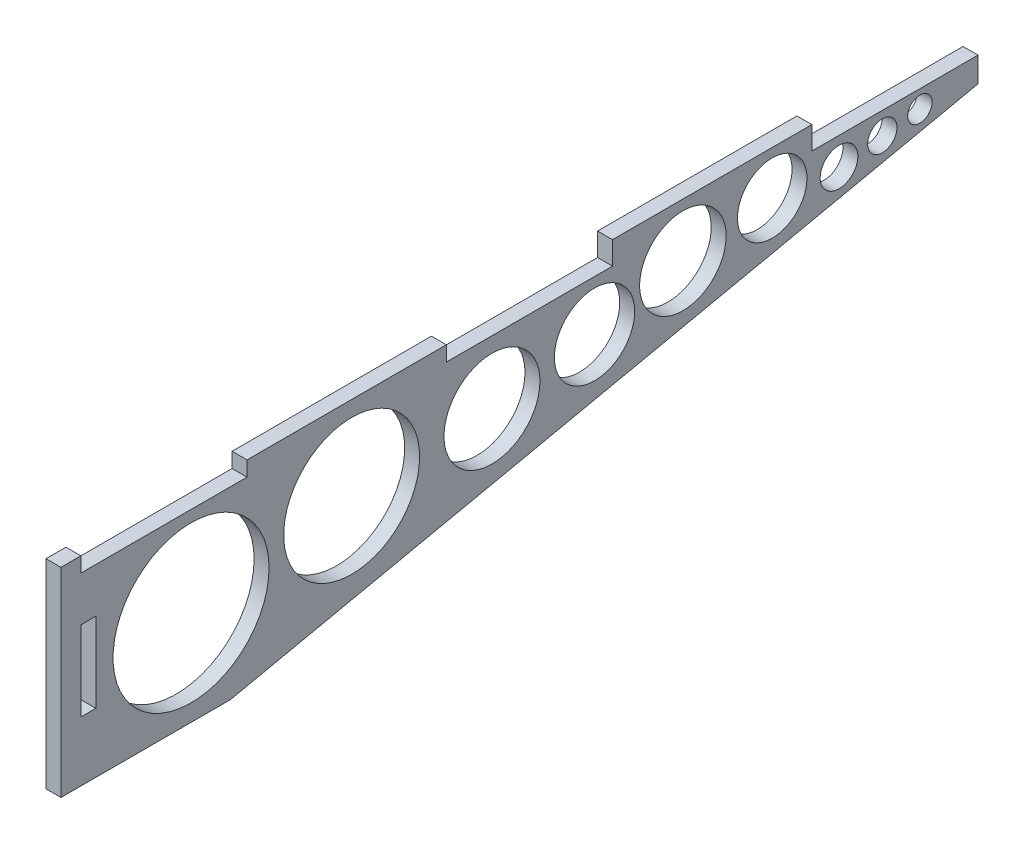
ISO-10303-21;
HEADER;
FILE_DESCRIPTION(('STEP AP214'),'2;1');
FILE_NAME('part.step','',(''),(''),'','','');
FILE_SCHEMA(('AUTOMOTIVE_DESIGN { 1 0 10303 214 1 1 1 1 }'));
ENDSEC;
DATA;
#1=APPLICATION_CONTEXT('core data for automotive mechanical design processes');
#2=APPLICATION_PROTOCOL_DEFINITION('international standard','automotive_design',2000,#1);
#3=PRODUCT_CONTEXT('',#1,'mechanical');
#4=PRODUCT('Part','Part','',(#3));
#5=PRODUCT_RELATED_PRODUCT_CATEGORY('part','',(#4));
#6=PRODUCT_DEFINITION_FORMATION('','',#4);
#7=PRODUCT_DEFINITION_CONTEXT('part definition',#1,'design');
#8=PRODUCT_DEFINITION('design','',#6,#7);
#9=PRODUCT_DEFINITION_SHAPE('','',#8);
#10=(LENGTH_UNIT() NAMED_UNIT(*) SI_UNIT(.MILLI.,.METRE.));
#11=(NAMED_UNIT(*) PLANE_ANGLE_UNIT() SI_UNIT($,.RADIAN.));
#12=(NAMED_UNIT(*) SI_UNIT($,.STERADIAN.) SOLID_ANGLE_UNIT());
#13=UNCERTAINTY_MEASURE_WITH_UNIT(LENGTH_MEASURE(1.E-05),#10,'distance_accuracy_value','');
#14=(GEOMETRIC_REPRESENTATION_CONTEXT(3) GLOBAL_UNCERTAINTY_ASSIGNED_CONTEXT((#13)) GLOBAL_UNIT_ASSIGNED_CONTEXT((#10,
#11,#12)) REPRESENTATION_CONTEXT('',''));
#15=CARTESIAN_POINT('',(0.,0.,0.));
#16=DIRECTION('',(0.,0.,1.));
#17=DIRECTION('',(1.,0.,0.));
#18=AXIS2_PLACEMENT_3D('',#15,#16,#17);
#19=CARTESIAN_POINT('',(3.,-12.,0.));
#20=DIRECTION('',(0.,1.,0.));
#21=DIRECTION('',(0.,0.,1.));
#22=AXIS2_PLACEMENT_3D('',#19,#20,#21);
#23=PLANE('',#22);
#24=DIRECTION('',(0.,0.,-1.));
#25=VECTOR('',#24,1.);
#26=CARTESIAN_POINT('',(0.,-12.,0.));
#27=LINE('',#26,#25);
#28=CARTESIAN_POINT('',(0.,-12.,0.));
#29=VERTEX_POINT('',#28);
#30=CARTESIAN_POINT('',(0.,-12.,-3.));
#31=VERTEX_POINT('',#30);
#32=EDGE_CURVE('E237',#29,#31,#27,.T.);
#33=ORIENTED_EDGE('',*,*,#32,.T.);
#34=DIRECTION('',(-1.,0.,0.));
#35=VECTOR('',#34,1.);
#36=CARTESIAN_POINT('',(3.,-12.,-3.));
#37=LINE('',#36,#35);
#38=CARTESIAN_POINT('',(3.,-12.,-3.));
#39=VERTEX_POINT('',#38);
#40=EDGE_CURVE('E11',#39,#31,#37,.T.);
#41=ORIENTED_EDGE('',*,*,#40,.F.);
#42=DIRECTION('',(0.,0.,-1.));
#43=VECTOR('',#42,1.);
#44=CARTESIAN_POINT('',(3.,-12.,0.));
#45=LINE('',#44,#43);
#46=CARTESIAN_POINT('',(3.,-12.,0.));
#47=VERTEX_POINT('',#46);
#48=EDGE_CURVE('E177',#47,#39,#45,.T.);
#49=ORIENTED_EDGE('',*,*,#48,.F.);
#50=DIRECTION('',(-1.,0.,0.));
#51=VECTOR('',#50,1.);
#52=CARTESIAN_POINT('',(3.,-12.,0.));
#53=LINE('',#52,#51);
#54=EDGE_CURVE('E58',#47,#29,#53,.T.);
#55=ORIENTED_EDGE('',*,*,#54,.T.);
#56=EDGE_LOOP('',(#33,#41,#49,#55));
#57=FACE_BOUND('',#56,.T.);
#58=ADVANCED_FACE('F39',(#57),#23,.F.);
#59=CARTESIAN_POINT('',(3.,0.,-3.));
#60=DIRECTION('',(0.,0.,-1.));
#61=DIRECTION('',(0.,1.,0.));
#62=AXIS2_PLACEMENT_3D('',#59,#60,#61);
#63=PLANE('',#62);
#64=DIRECTION('',(0.,-1.,0.));
#65=VECTOR('',#64,1.);
#66=CARTESIAN_POINT('',(0.,0.,-3.));
#67=LINE('',#66,#65);
#68=CARTESIAN_POINT('',(0.,-28.,-3.));
#69=VERTEX_POINT('',#68);
#70=EDGE_CURVE('E183',#31,#69,#67,.T.);
#71=ORIENTED_EDGE('',*,*,#70,.T.);
#72=DIRECTION('',(-1.,0.,0.));
#73=VECTOR('',#72,1.);
#74=CARTESIAN_POINT('',(3.,-28.,-3.));
#75=LINE('',#74,#73);
#76=CARTESIAN_POINT('',(3.,-28.,-3.));
#77=VERTEX_POINT('',#76);
#78=EDGE_CURVE('E49',#77,#69,#75,.T.);
#79=ORIENTED_EDGE('',*,*,#78,.F.);
#80=DIRECTION('',(0.,-1.,0.));
#81=VECTOR('',#80,1.);
#82=CARTESIAN_POINT('',(3.,0.,-3.));
#83=LINE('',#82,#81);
#84=EDGE_CURVE('E171',#39,#77,#83,.T.);
#85=ORIENTED_EDGE('',*,*,#84,.F.);
#86=ORIENTED_EDGE('',*,*,#40,.T.);
#87=EDGE_LOOP('',(#71,#79,#85,#86));
#88=FACE_BOUND('',#87,.T.);
#89=ADVANCED_FACE('F182',(#88),#63,.F.);
#90=CARTESIAN_POINT('',(3.,-28.,0.));
#91=DIRECTION('',(0.,1.,0.));
#92=DIRECTION('',(0.,0.,1.));
#93=AXIS2_PLACEMENT_3D('',#90,#91,#92);
#94=PLANE('',#93);
#95=DIRECTION('',(0.,0.,-1.));
#96=VECTOR('',#95,1.);
#97=CARTESIAN_POINT('',(0.,-28.,0.));
#98=LINE('',#97,#96);
#99=CARTESIAN_POINT('',(0.,-28.,0.));
#100=VERTEX_POINT('',#99);
#101=EDGE_CURVE('E240',#100,#69,#98,.T.);
#102=ORIENTED_EDGE('',*,*,#101,.F.);
#103=DIRECTION('',(-1.,0.,0.));
#104=VECTOR('',#103,1.);
#105=CARTESIAN_POINT('',(3.,-28.,0.));
#106=LINE('',#105,#104);
#107=CARTESIAN_POINT('',(3.,-28.,0.));
#108=VERTEX_POINT('',#107);
#109=EDGE_CURVE('E112',#108,#100,#106,.T.);
#110=ORIENTED_EDGE('',*,*,#109,.F.);
#111=DIRECTION('',(0.,0.,-1.));
#112=VECTOR('',#111,1.);
#113=CARTESIAN_POINT('',(3.,-28.,0.));
#114=LINE('',#113,#112);
#115=EDGE_CURVE('E176',#108,#77,#114,.T.);
#116=ORIENTED_EDGE('',*,*,#115,.T.);
#117=ORIENTED_EDGE('',*,*,#78,.T.);
#118=EDGE_LOOP('',(#102,#110,#116,#117));
#119=FACE_BOUND('',#118,.T.);
#120=ADVANCED_FACE('F187',(#119),#94,.T.);
#121=CARTESIAN_POINT('',(3.,0.,0.));
#122=DIRECTION('',(0.,1.,0.));
#123=DIRECTION('',(0.,0.,1.));
#124=AXIS2_PLACEMENT_3D('',#121,#122,#123);
#125=PLANE('',#124);
#126=DIRECTION('',(0.,0.,-1.));
#127=VECTOR('',#126,1.);
#128=CARTESIAN_POINT('',(0.,0.,0.));
#129=LINE('',#128,#127);
#130=CARTESIAN_POINT('',(0.,0.,4.));
#131=VERTEX_POINT('',#130);
#132=CARTESIAN_POINT('',(0.,0.,0.));
#133=VERTEX_POINT('',#132);
#134=EDGE_CURVE('E194',#131,#133,#129,.T.);
#135=ORIENTED_EDGE('',*,*,#134,.F.);
#136=DIRECTION('',(-1.,0.,0.));
#137=VECTOR('',#136,1.);
#138=CARTESIAN_POINT('',(3.,0.,4.));
#139=LINE('',#138,#137);
#140=CARTESIAN_POINT('',(3.,0.,4.));
#141=VERTEX_POINT('',#140);
#142=EDGE_CURVE('E124',#141,#131,#139,.T.);
#143=ORIENTED_EDGE('',*,*,#142,.F.);
#144=DIRECTION('',(0.,0.,-1.));
#145=VECTOR('',#144,1.);
#146=CARTESIAN_POINT('',(3.,0.,0.));
#147=LINE('',#146,#145);
#148=CARTESIAN_POINT('',(3.,0.,0.));
#149=VERTEX_POINT('',#148);
#150=EDGE_CURVE('E245',#141,#149,#147,.T.);
#151=ORIENTED_EDGE('',*,*,#150,.T.);
#152=DIRECTION('',(-1.,0.,0.));
#153=VECTOR('',#152,1.);
#154=CARTESIAN_POINT('',(3.,0.,0.));
#155=LINE('',#154,#153);
#156=EDGE_CURVE('E190',#149,#133,#155,.T.);
#157=ORIENTED_EDGE('',*,*,#156,.T.);
#158=EDGE_LOOP('',(#135,#143,#151,#157));
#159=FACE_BOUND('',#158,.T.);
#160=ADVANCED_FACE('F41',(#159),#125,.T.);
#161=CARTESIAN_POINT('',(3.,0.,4.));
#162=DIRECTION('',(0.,0.,1.));
#163=DIRECTION('',(1.,0.,0.));
#164=AXIS2_PLACEMENT_3D('',#161,#162,#163);
#165=PLANE('',#164);
#166=DIRECTION('',(0.,1.,0.));
#167=VECTOR('',#166,1.);
#168=CARTESIAN_POINT('',(0.,0.,4.));
#169=LINE('',#168,#167);
#170=CARTESIAN_POINT('',(0.,-40.,4.));
#171=VERTEX_POINT('',#170);
#172=EDGE_CURVE('E197',#171,#131,#169,.T.);
#173=ORIENTED_EDGE('',*,*,#172,.F.);
#174=DIRECTION('',(-1.,0.,0.));
#175=VECTOR('',#174,1.);
#176=CARTESIAN_POINT('',(3.,-40.,4.));
#177=LINE('',#176,#175);
#178=CARTESIAN_POINT('',(3.,-40.,4.));
#179=VERTEX_POINT('',#178);
#180=EDGE_CURVE('E269',#179,#171,#177,.T.);
#181=ORIENTED_EDGE('',*,*,#180,.F.);
#182=DIRECTION('',(0.,1.,0.));
#183=VECTOR('',#182,1.);
#184=CARTESIAN_POINT('',(3.,0.,4.));
#185=LINE('',#184,#183);
#186=EDGE_CURVE('E317',#179,#141,#185,.T.);
#187=ORIENTED_EDGE('',*,*,#186,.T.);
#188=ORIENTED_EDGE('',*,*,#142,.T.);
#189=EDGE_LOOP('',(#173,#181,#187,#188));
#190=FACE_BOUND('',#189,.T.);
#191=ADVANCED_FACE('F371',(#190),#165,.T.);
#192=CARTESIAN_POINT('',(3.,-40.,0.));
#193=DIRECTION('',(0.,-1.,0.));
#194=DIRECTION('',(0.,0.,-1.));
#195=AXIS2_PLACEMENT_3D('',#192,#193,#194);
#196=PLANE('',#195);
#197=DIRECTION('',(0.,0.,1.));
#198=VECTOR('',#197,1.);
#199=CARTESIAN_POINT('',(0.,-40.,0.));
#200=LINE('',#199,#198);
#201=CARTESIAN_POINT('',(0.,-40.,-30.));
#202=VERTEX_POINT('',#201);
#203=EDGE_CURVE('E201',#202,#171,#200,.T.);
#204=ORIENTED_EDGE('',*,*,#203,.F.);
#205=DIRECTION('',(-1.,0.,0.));
#206=VECTOR('',#205,1.);
#207=CARTESIAN_POINT('',(3.,-40.,-30.));
#208=LINE('',#207,#206);
#209=CARTESIAN_POINT('',(3.,-40.,-30.));
#210=VERTEX_POINT('',#209);
#211=EDGE_CURVE('E267',#210,#202,#208,.T.);
#212=ORIENTED_EDGE('',*,*,#211,.F.);
#213=DIRECTION('',(0.,0.,1.));
#214=VECTOR('',#213,1.);
#215=CARTESIAN_POINT('',(3.,-40.,0.));
#216=LINE('',#215,#214);
#217=EDGE_CURVE('E320',#210,#179,#216,.T.);
#218=ORIENTED_EDGE('',*,*,#217,.T.);
#219=ORIENTED_EDGE('',*,*,#180,.T.);
#220=EDGE_LOOP('',(#204,#212,#218,#219));
#221=FACE_BOUND('',#220,.T.);
#222=ADVANCED_FACE('F376',(#221),#196,.T.);
#223=CARTESIAN_POINT('',(3.,-44.380207447713,-9.46777758884544));
#224=DIRECTION('',(0.,-0.977992836424307,-0.208638471770519));
#225=DIRECTION('',(0.,0.208638471770519,-0.977992836424308));
#226=AXIS2_PLACEMENT_3D('',#223,#224,#225);
#227=PLANE('',#226);
#228=DIRECTION('',(0.,-0.208638471770519,0.977992836424308));
#229=VECTOR('',#228,1.);
#230=CARTESIAN_POINT('',(0.,-44.380207447713,-9.46777758884544));
#231=LINE('',#230,#229);
#232=CARTESIAN_POINT('',(0.,-7.99999999999999,-180.));
#233=VERTEX_POINT('',#232);
#234=EDGE_CURVE('E204',#233,#202,#231,.T.);
#235=ORIENTED_EDGE('',*,*,#234,.F.);
#236=DIRECTION('',(-1.,0.,0.));
#237=VECTOR('',#236,1.);
#238=CARTESIAN_POINT('',(3.,-7.99999999999999,-180.));
#239=LINE('',#238,#237);
#240=CARTESIAN_POINT('',(3.,-7.99999999999999,-180.));
#241=VERTEX_POINT('',#240);
#242=EDGE_CURVE('E265',#241,#233,#239,.T.);
#243=ORIENTED_EDGE('',*,*,#242,.F.);
#244=DIRECTION('',(0.,-0.208638471770519,0.977992836424308));
#245=VECTOR('',#244,1.);
#246=CARTESIAN_POINT('',(3.,-44.380207447713,-9.46777758884544));
#247=LINE('',#246,#245);
#248=EDGE_CURVE('E323',#241,#210,#247,.T.);
#249=ORIENTED_EDGE('',*,*,#248,.T.);
#250=ORIENTED_EDGE('',*,*,#211,.T.);
#251=EDGE_LOOP('',(#235,#243,#249,#250));
#252=FACE_BOUND('',#251,.T.);
#253=ADVANCED_FACE('F422',(#252),#227,.T.);
#254=CARTESIAN_POINT('',(3.,0.,-180.));
#255=DIRECTION('',(0.,0.,-1.));
#256=DIRECTION('',(-1.,0.,0.));
#257=AXIS2_PLACEMENT_3D('',#254,#255,#256);
#258=PLANE('',#257);
#259=DIRECTION('',(0.,-1.,0.));
#260=VECTOR('',#259,1.);
#261=CARTESIAN_POINT('',(0.,0.,-180.));
#262=LINE('',#261,#260);
#263=CARTESIAN_POINT('',(0.,-3.,-180.));
#264=VERTEX_POINT('',#263);
#265=EDGE_CURVE('E207',#264,#233,#262,.T.);
#266=ORIENTED_EDGE('',*,*,#265,.F.);
#267=DIRECTION('',(-1.,0.,0.));
#268=VECTOR('',#267,1.);
#269=CARTESIAN_POINT('',(3.,-3.,-180.));
#270=LINE('',#269,#268);
#271=CARTESIAN_POINT('',(3.,-3.,-180.));
#272=VERTEX_POINT('',#271);
#273=EDGE_CURVE('E263',#272,#264,#270,.T.);
#274=ORIENTED_EDGE('',*,*,#273,.F.);
#275=DIRECTION('',(0.,-1.,0.));
#276=VECTOR('',#275,1.);
#277=CARTESIAN_POINT('',(3.,0.,-180.));
#278=LINE('',#277,#276);
#279=EDGE_CURVE('E326',#272,#241,#278,.T.);
#280=ORIENTED_EDGE('',*,*,#279,.T.);
#281=ORIENTED_EDGE('',*,*,#242,.T.);
#282=EDGE_LOOP('',(#266,#274,#280,#281));
#283=FACE_BOUND('',#282,.T.);
#284=ADVANCED_FACE('F418',(#283),#258,.T.);
#285=CARTESIAN_POINT('',(3.,-3.,0.));
#286=DIRECTION('',(0.,1.,0.));
#287=DIRECTION('',(0.,0.,1.));
#288=AXIS2_PLACEMENT_3D('',#285,#286,#287);
#289=PLANE('',#288);
#290=DIRECTION('',(0.,0.,-1.));
#291=VECTOR('',#290,1.);
#292=CARTESIAN_POINT('',(0.,-3.,0.));
#293=LINE('',#292,#291);
#294=CARTESIAN_POINT('',(0.,-3.,-146.666666666667));
#295=VERTEX_POINT('',#294);
#296=EDGE_CURVE('E210',#295,#264,#293,.T.);
#297=ORIENTED_EDGE('',*,*,#296,.F.);
#298=DIRECTION('',(-1.,0.,0.));
#299=VECTOR('',#298,1.);
#300=CARTESIAN_POINT('',(3.,-3.,-146.666666666667));
#301=LINE('',#300,#299);
#302=CARTESIAN_POINT('',(3.,-3.,-146.666666666667));
#303=VERTEX_POINT('',#302);
#304=EDGE_CURVE('E261',#303,#295,#301,.T.);
#305=ORIENTED_EDGE('',*,*,#304,.F.);
#306=DIRECTION('',(0.,0.,-1.));
#307=VECTOR('',#306,1.);
#308=CARTESIAN_POINT('',(3.,-3.,0.));
#309=LINE('',#308,#307);
#310=EDGE_CURVE('E329',#303,#272,#309,.T.);
#311=ORIENTED_EDGE('',*,*,#310,.T.);
#312=ORIENTED_EDGE('',*,*,#273,.T.);
#313=EDGE_LOOP('',(#297,#305,#311,#312));
#314=FACE_BOUND('',#313,.T.);
#315=ADVANCED_FACE('F414',(#314),#289,.T.);
#316=CARTESIAN_POINT('',(3.,0.,-146.666666666667));
#317=DIRECTION('',(0.,0.,-1.));
#318=DIRECTION('',(-1.,0.,0.));
#319=AXIS2_PLACEMENT_3D('',#316,#317,#318);
#320=PLANE('',#319);
#321=DIRECTION('',(0.,-1.,0.));
#322=VECTOR('',#321,1.);
#323=CARTESIAN_POINT('',(0.,0.,-146.666666666667));
#324=LINE('',#323,#322);
#325=CARTESIAN_POINT('',(0.,1.6,-146.666666666667));
#326=VERTEX_POINT('',#325);
#327=EDGE_CURVE('E213',#326,#295,#324,.T.);
#328=ORIENTED_EDGE('',*,*,#327,.F.);
#329=DIRECTION('',(1.,0.,0.));
#330=VECTOR('',#329,1.);
#331=CARTESIAN_POINT('',(0.,1.6,-146.666666666667));
#332=LINE('',#331,#330);
#333=CARTESIAN_POINT('',(3.,1.6,-146.666666666667));
#334=VERTEX_POINT('',#333);
#335=EDGE_CURVE('E308',#326,#334,#332,.T.);
#336=ORIENTED_EDGE('',*,*,#335,.T.);
#337=DIRECTION('',(0.,-1.,0.));
#338=VECTOR('',#337,1.);
#339=CARTESIAN_POINT('',(3.,0.,-146.666666666667));
#340=LINE('',#339,#338);
#341=EDGE_CURVE('E332',#334,#303,#340,.T.);
#342=ORIENTED_EDGE('',*,*,#341,.T.);
#343=ORIENTED_EDGE('',*,*,#304,.T.);
#344=EDGE_LOOP('',(#328,#336,#342,#343));
#345=FACE_BOUND('',#344,.T.);
#346=ADVANCED_FACE('F410',(#345),#320,.T.);
#347=CARTESIAN_POINT('',(3.,-4.93432455388958E-13,-106.666666666667));
#348=DIRECTION('',(0.,0.,-1.));
#349=DIRECTION('',(0.,1.,0.));
#350=AXIS2_PLACEMENT_3D('',#347,#348,#349);
#351=PLANE('',#350);
#352=DIRECTION('',(0.,-1.,0.));
#353=VECTOR('',#352,1.);
#354=CARTESIAN_POINT('',(0.,-4.93432455388958E-13,-106.666666666667));
#355=LINE('',#354,#353);
#356=CARTESIAN_POINT('',(0.,1.6,-106.666666666667));
#357=VERTEX_POINT('',#356);
#358=CARTESIAN_POINT('',(0.,-3.,-106.666666666667));
#359=VERTEX_POINT('',#358);
#360=EDGE_CURVE('E216',#357,#359,#355,.T.);
#361=ORIENTED_EDGE('',*,*,#360,.T.);
#362=DIRECTION('',(-1.,0.,0.));
#363=VECTOR('',#362,1.);
#364=CARTESIAN_POINT('',(3.,-3.,-106.666666666667));
#365=LINE('',#364,#363);
#366=CARTESIAN_POINT('',(3.,-3.,-106.666666666667));
#367=VERTEX_POINT('',#366);
#368=EDGE_CURVE('E259',#367,#359,#365,.T.);
#369=ORIENTED_EDGE('',*,*,#368,.F.);
#370=DIRECTION('',(0.,-1.,0.));
#371=VECTOR('',#370,1.);
#372=CARTESIAN_POINT('',(3.,-4.93432455388958E-13,-106.666666666667));
#373=LINE('',#372,#371);
#374=CARTESIAN_POINT('',(3.,1.6,-106.666666666667));
#375=VERTEX_POINT('',#374);
#376=EDGE_CURVE('E335',#375,#367,#373,.T.);
#377=ORIENTED_EDGE('',*,*,#376,.F.);
#378=DIRECTION('',(1.,0.,0.));
#379=VECTOR('',#378,1.);
#380=CARTESIAN_POINT('',(0.,1.6,-106.666666666667));
#381=LINE('',#380,#379);
#382=EDGE_CURVE('E198',#357,#375,#381,.T.);
#383=ORIENTED_EDGE('',*,*,#382,.F.);
#384=EDGE_LOOP('',(#361,#369,#377,#383));
#385=FACE_BOUND('',#384,.T.);
#386=ADVANCED_FACE('F406',(#385),#351,.F.);
#387=CARTESIAN_POINT('',(3.,-3.,0.));
#388=DIRECTION('',(0.,1.,0.));
#389=DIRECTION('',(0.,0.,1.));
#390=AXIS2_PLACEMENT_3D('',#387,#388,#389);
#391=PLANE('',#390);
#392=DIRECTION('',(0.,0.,-1.));
#393=VECTOR('',#392,1.);
#394=CARTESIAN_POINT('',(0.,-3.,0.));
#395=LINE('',#394,#393);
#396=CARTESIAN_POINT('',(0.,-3.,-73.3333333333333));
#397=VERTEX_POINT('',#396);
#398=EDGE_CURVE('E224',#397,#359,#395,.T.);
#399=ORIENTED_EDGE('',*,*,#398,.F.);
#400=DIRECTION('',(-1.,0.,0.));
#401=VECTOR('',#400,1.);
#402=CARTESIAN_POINT('',(3.,-3.,-73.3333333333333));
#403=LINE('',#402,#401);
#404=CARTESIAN_POINT('',(3.,-3.,-73.3333333333333));
#405=VERTEX_POINT('',#404);
#406=EDGE_CURVE('E257',#405,#397,#403,.T.);
#407=ORIENTED_EDGE('',*,*,#406,.F.);
#408=DIRECTION('',(0.,0.,-1.));
#409=VECTOR('',#408,1.);
#410=CARTESIAN_POINT('',(3.,-3.,0.));
#411=LINE('',#410,#409);
#412=EDGE_CURVE('E342',#405,#367,#411,.T.);
#413=ORIENTED_EDGE('',*,*,#412,.T.);
#414=ORIENTED_EDGE('',*,*,#368,.T.);
#415=EDGE_LOOP('',(#399,#407,#413,#414));
#416=FACE_BOUND('',#415,.T.);
#417=ADVANCED_FACE('F402',(#416),#391,.T.);
#418=CARTESIAN_POINT('',(3.,0.,-73.3333333333333));
#419=DIRECTION('',(0.,0.,-1.));
#420=DIRECTION('',(-1.,0.,0.));
#421=AXIS2_PLACEMENT_3D('',#418,#419,#420);
#422=PLANE('',#421);
#423=DIRECTION('',(0.,-1.,0.));
#424=VECTOR('',#423,1.);
#425=CARTESIAN_POINT('',(0.,0.,-73.3333333333333));
#426=LINE('',#425,#424);
#427=CARTESIAN_POINT('',(0.,0.,-73.3333333333333));
#428=VERTEX_POINT('',#427);
#429=EDGE_CURVE('E221',#428,#397,#426,.T.);
#430=ORIENTED_EDGE('',*,*,#429,.F.);
#431=DIRECTION('',(-1.,0.,0.));
#432=VECTOR('',#431,1.);
#433=CARTESIAN_POINT('',(3.,0.,-73.3333333333333));
#434=LINE('',#433,#432);
#435=CARTESIAN_POINT('',(3.,0.,-73.3333333333333));
#436=VERTEX_POINT('',#435);
#437=EDGE_CURVE('E255',#436,#428,#434,.T.);
#438=ORIENTED_EDGE('',*,*,#437,.F.);
#439=DIRECTION('',(0.,-1.,0.));
#440=VECTOR('',#439,1.);
#441=CARTESIAN_POINT('',(3.,0.,-73.3333333333333));
#442=LINE('',#441,#440);
#443=EDGE_CURVE('E340',#436,#405,#442,.T.);
#444=ORIENTED_EDGE('',*,*,#443,.T.);
#445=ORIENTED_EDGE('',*,*,#406,.T.);
#446=EDGE_LOOP('',(#430,#438,#444,#445));
#447=FACE_BOUND('',#446,.T.);
#448=ADVANCED_FACE('F398',(#447),#422,.T.);
#449=CARTESIAN_POINT('',(3.,0.,0.));
#450=DIRECTION('',(0.,1.,0.));
#451=DIRECTION('',(0.,0.,1.));
#452=AXIS2_PLACEMENT_3D('',#449,#450,#451);
#453=PLANE('',#452);
#454=DIRECTION('',(0.,0.,-1.));
#455=VECTOR('',#454,1.);
#456=CARTESIAN_POINT('',(0.,0.,0.));
#457=LINE('',#456,#455);
#458=CARTESIAN_POINT('',(0.,0.,-33.3333333333333));
#459=VERTEX_POINT('',#458);
#460=EDGE_CURVE('E217',#459,#428,#457,.T.);
#461=ORIENTED_EDGE('',*,*,#460,.F.);
#462=DIRECTION('',(-1.,0.,0.));
#463=VECTOR('',#462,1.);
#464=CARTESIAN_POINT('',(3.,0.,-33.3333333333333));
#465=LINE('',#464,#463);
#466=CARTESIAN_POINT('',(3.,0.,-33.3333333333333));
#467=VERTEX_POINT('',#466);
#468=EDGE_CURVE('E253',#467,#459,#465,.T.);
#469=ORIENTED_EDGE('',*,*,#468,.F.);
#470=DIRECTION('',(0.,0.,-1.));
#471=VECTOR('',#470,1.);
#472=CARTESIAN_POINT('',(3.,0.,0.));
#473=LINE('',#472,#471);
#474=EDGE_CURVE('E336',#467,#436,#473,.T.);
#475=ORIENTED_EDGE('',*,*,#474,.T.);
#476=ORIENTED_EDGE('',*,*,#437,.T.);
#477=EDGE_LOOP('',(#461,#469,#475,#476));
#478=FACE_BOUND('',#477,.T.);
#479=ADVANCED_FACE('F394',(#478),#453,.T.);
#480=CARTESIAN_POINT('',(3.,0.,-33.3333333333333));
#481=DIRECTION('',(0.,0.,-1.));
#482=DIRECTION('',(0.,1.,0.));
#483=AXIS2_PLACEMENT_3D('',#480,#481,#482);
#484=PLANE('',#483);
#485=DIRECTION('',(0.,-1.,0.));
#486=VECTOR('',#485,1.);
#487=CARTESIAN_POINT('',(0.,0.,-33.3333333333333));
#488=LINE('',#487,#486);
#489=CARTESIAN_POINT('',(0.,-3.,-33.3333333333333));
#490=VERTEX_POINT('',#489);
#491=EDGE_CURVE('E220',#459,#490,#488,.T.);
#492=ORIENTED_EDGE('',*,*,#491,.T.);
#493=DIRECTION('',(-1.,0.,0.));
#494=VECTOR('',#493,1.);
#495=CARTESIAN_POINT('',(3.,-3.,-33.3333333333333));
#496=LINE('',#495,#494);
#497=CARTESIAN_POINT('',(3.,-3.,-33.3333333333333));
#498=VERTEX_POINT('',#497);
#499=EDGE_CURVE('E251',#498,#490,#496,.T.);
#500=ORIENTED_EDGE('',*,*,#499,.F.);
#501=DIRECTION('',(0.,-1.,0.));
#502=VECTOR('',#501,1.);
#503=CARTESIAN_POINT('',(3.,0.,-33.3333333333333));
#504=LINE('',#503,#502);
#505=EDGE_CURVE('E339',#467,#498,#504,.T.);
#506=ORIENTED_EDGE('',*,*,#505,.F.);
#507=ORIENTED_EDGE('',*,*,#468,.T.);
#508=EDGE_LOOP('',(#492,#500,#506,#507));
#509=FACE_BOUND('',#508,.T.);
#510=ADVANCED_FACE('F391',(#509),#484,.F.);
#511=CARTESIAN_POINT('',(3.,-3.,0.));
#512=DIRECTION('',(0.,1.,0.));
#513=DIRECTION('',(0.,0.,1.));
#514=AXIS2_PLACEMENT_3D('',#511,#512,#513);
#515=PLANE('',#514);
#516=DIRECTION('',(0.,0.,-1.));
#517=VECTOR('',#516,1.);
#518=CARTESIAN_POINT('',(0.,-3.,0.));
#519=LINE('',#518,#517);
#520=CARTESIAN_POINT('',(0.,-3.,0.));
#521=VERTEX_POINT('',#520);
#522=EDGE_CURVE('E231',#521,#490,#519,.T.);
#523=ORIENTED_EDGE('',*,*,#522,.F.);
#524=DIRECTION('',(-1.,0.,0.));
#525=VECTOR('',#524,1.);
#526=CARTESIAN_POINT('',(3.,-3.,0.));
#527=LINE('',#526,#525);
#528=CARTESIAN_POINT('',(3.,-3.,0.));
#529=VERTEX_POINT('',#528);
#530=EDGE_CURVE('E249',#529,#521,#527,.T.);
#531=ORIENTED_EDGE('',*,*,#530,.F.);
#532=DIRECTION('',(0.,0.,-1.));
#533=VECTOR('',#532,1.);
#534=CARTESIAN_POINT('',(3.,-3.,0.));
#535=LINE('',#534,#533);
#536=EDGE_CURVE('E348',#529,#498,#535,.T.);
#537=ORIENTED_EDGE('',*,*,#536,.T.);
#538=ORIENTED_EDGE('',*,*,#499,.T.);
#539=EDGE_LOOP('',(#523,#531,#537,#538));
#540=FACE_BOUND('',#539,.T.);
#541=ADVANCED_FACE('F364',(#540),#515,.T.);
#542=CARTESIAN_POINT('',(3.,0.,0.));
#543=DIRECTION('',(0.,0.,-1.));
#544=DIRECTION('',(0.,1.,0.));
#545=AXIS2_PLACEMENT_3D('',#542,#543,#544);
#546=PLANE('',#545);
#547=DIRECTION('',(0.,-1.,0.));
#548=VECTOR('',#547,1.);
#549=CARTESIAN_POINT('',(0.,0.,0.));
#550=LINE('',#549,#548);
#551=EDGE_CURVE('E234',#133,#521,#550,.T.);
#552=ORIENTED_EDGE('',*,*,#551,.F.);
#553=ORIENTED_EDGE('',*,*,#156,.F.);
#554=DIRECTION('',(0.,-1.,0.));
#555=VECTOR('',#554,1.);
#556=CARTESIAN_POINT('',(3.,0.,0.));
#557=LINE('',#556,#555);
#558=EDGE_CURVE('E351',#149,#529,#557,.T.);
#559=ORIENTED_EDGE('',*,*,#558,.T.);
#560=ORIENTED_EDGE('',*,*,#530,.T.);
#561=EDGE_LOOP('',(#552,#553,#559,#560));
#562=FACE_BOUND('',#561,.T.);
#563=ADVANCED_FACE('F356',(#562),#546,.T.);
#564=CARTESIAN_POINT('',(3.,0.,0.));
#565=DIRECTION('',(0.,0.,-1.));
#566=DIRECTION('',(0.,1.,0.));
#567=AXIS2_PLACEMENT_3D('',#564,#565,#566);
#568=PLANE('',#567);
#569=DIRECTION('',(0.,-1.,0.));
#570=VECTOR('',#569,1.);
#571=CARTESIAN_POINT('',(0.,0.,0.));
#572=LINE('',#571,#570);
#573=EDGE_CURVE('E242',#29,#100,#572,.T.);
#574=ORIENTED_EDGE('',*,*,#573,.F.);
#575=ORIENTED_EDGE('',*,*,#54,.F.);
#576=DIRECTION('',(0.,-1.,0.));
#577=VECTOR('',#576,1.);
#578=CARTESIAN_POINT('',(3.,0.,0.));
#579=LINE('',#578,#577);
#580=EDGE_CURVE('E188',#47,#108,#579,.T.);
#581=ORIENTED_EDGE('',*,*,#580,.T.);
#582=ORIENTED_EDGE('',*,*,#109,.T.);
#583=EDGE_LOOP('',(#574,#575,#581,#582));
#584=FACE_BOUND('',#583,.T.);
#585=ADVANCED_FACE('F388',(#584),#568,.T.);
#586=CARTESIAN_POINT('',(3.,0.,0.));
#587=DIRECTION('',(1.,0.,0.));
#588=DIRECTION('',(0.,0.,-1.));
#589=AXIS2_PLACEMENT_3D('',#586,#587,#588);
#590=PLANE('',#589);
#591=CARTESIAN_POINT('',(3.,-20.9560950708637,-22.1045634428108));
#592=DIRECTION('',(1.,0.,0.));
#593=DIRECTION('',(0.,0.,-1.));
#594=AXIS2_PLACEMENT_3D('',#591,#592,#593);
#595=CIRCLE('',#594,15.6510505084061);
#596=CARTESIAN_POINT('',(3.,-20.9560950708637,-37.7556139512169));
#597=VERTEX_POINT('',#596);
#598=EDGE_CURVE('E276',#597,#597,#595,.T.);
#599=ORIENTED_EDGE('',*,*,#598,.F.);
#600=EDGE_LOOP('',(#599));
#601=FACE_BOUND('',#600,.T.);
#602=CARTESIAN_POINT('',(3.,-16.7522539708052,-54.3289430759278));
#603=DIRECTION('',(1.,0.,0.));
#604=DIRECTION('',(0.,0.,-1.));
#605=AXIS2_PLACEMENT_3D('',#602,#603,#604);
#606=CIRCLE('',#605,13.6364046168327);
#607=CARTESIAN_POINT('',(3.,-16.7522539708052,-67.9653476927605));
#608=VERTEX_POINT('',#607);
#609=EDGE_CURVE('E754',#608,#608,#606,.T.);
#610=ORIENTED_EDGE('',*,*,#609,.F.);
#611=EDGE_LOOP('',(#610));
#612=FACE_BOUND('',#611,.T.);
#613=CARTESIAN_POINT('',(3.,-15.6731887085416,-82.4831177740318));
#614=DIRECTION('',(1.,0.,0.));
#615=DIRECTION('',(0.,0.,-1.));
#616=AXIS2_PLACEMENT_3D('',#613,#614,#615);
#617=CIRCLE('',#616,9.62536715508387);
#618=CARTESIAN_POINT('',(3.,-15.6731887085416,-92.1084849291157));
#619=VERTEX_POINT('',#618);
#620=EDGE_CURVE('E757',#619,#619,#617,.T.);
#621=ORIENTED_EDGE('',*,*,#620,.F.);
#622=EDGE_LOOP('',(#621));
#623=FACE_BOUND('',#622,.T.);
#624=CARTESIAN_POINT('',(3.,-13.0600675908749,-103.057816826271));
#625=DIRECTION('',(1.,0.,0.));
#626=DIRECTION('',(0.,0.,-1.));
#627=AXIS2_PLACEMENT_3D('',#624,#625,#626);
#628=CIRCLE('',#627,8.0556593826135);
#629=CARTESIAN_POINT('',(3.,-13.0600675908749,-111.113476208884));
#630=VERTEX_POINT('',#629);
#631=EDGE_CURVE('E762',#630,#630,#628,.T.);
#632=ORIENTED_EDGE('',*,*,#631,.F.);
#633=EDGE_LOOP('',(#632));
#634=FACE_BOUND('',#633,.T.);
#635=CARTESIAN_POINT('',(3.,-9.12831841128565,-120.792027676314));
#636=DIRECTION('',(1.,0.,0.));
#637=DIRECTION('',(0.,0.,-1.));
#638=AXIS2_PLACEMENT_3D('',#635,#636,#637);
#639=CIRCLE('',#638,8.6792975001501);
#640=CARTESIAN_POINT('',(3.,-9.12831841128565,-129.471325176464));
#641=VERTEX_POINT('',#640);
#642=EDGE_CURVE('E765',#641,#641,#639,.T.);
#643=ORIENTED_EDGE('',*,*,#642,.F.);
#644=EDGE_LOOP('',(#643));
#645=FACE_BOUND('',#644,.T.);
#646=CARTESIAN_POINT('',(3.,-7.42068427228523,-160.801244486573));
#647=DIRECTION('',(1.,0.,0.));
#648=DIRECTION('',(0.,0.,-1.));
#649=AXIS2_PLACEMENT_3D('',#646,#647,#648);
#650=CIRCLE('',#649,2.94345793045172);
#651=CARTESIAN_POINT('',(3.,-7.42068427228523,-163.744702417025));
#652=VERTEX_POINT('',#651);
#653=EDGE_CURVE('E773',#652,#652,#650,.T.);
#654=ORIENTED_EDGE('',*,*,#653,.F.);
#655=EDGE_LOOP('',(#654));
#656=FACE_BOUND('',#655,.T.);
#657=CARTESIAN_POINT('',(3.,-8.50229469868918,-152.117415018969));
#658=DIRECTION('',(1.,0.,0.));
#659=DIRECTION('',(0.,0.,-1.));
#660=AXIS2_PLACEMENT_3D('',#657,#658,#659);
#661=CIRCLE('',#660,3.77952359495901);
#662=CARTESIAN_POINT('',(3.,-8.50229469868918,-155.896938613928));
#663=VERTEX_POINT('',#662);
#664=EDGE_CURVE('E769',#663,#663,#661,.T.);
#665=ORIENTED_EDGE('',*,*,#664,.F.);
#666=EDGE_LOOP('',(#665));
#667=FACE_BOUND('',#666,.T.);
#668=CARTESIAN_POINT('',(3.,-6.54853953830057,-168.340077714851));
#669=DIRECTION('',(1.,0.,0.));
#670=DIRECTION('',(0.,0.,-1.));
#671=AXIS2_PLACEMENT_3D('',#668,#669,#670);
#672=CIRCLE('',#671,2.44641881461672);
#673=CARTESIAN_POINT('',(3.,-6.54853953830057,-170.786496529468));
#674=VERTEX_POINT('',#673);
#675=EDGE_CURVE('E772',#674,#674,#672,.T.);
#676=ORIENTED_EDGE('',*,*,#675,.F.);
#677=EDGE_LOOP('',(#676));
#678=FACE_BOUND('',#677,.T.);
#679=CARTESIAN_POINT('',(3.,-7.19226037878484,-138.707850433637));
#680=DIRECTION('',(1.,0.,0.));
#681=DIRECTION('',(0.,0.,-1.));
#682=AXIS2_PLACEMENT_3D('',#679,#680,#681);
#683=CIRCLE('',#682,6.97400588121129);
#684=CARTESIAN_POINT('',(3.,-7.19226037878484,-145.681856314849));
#685=VERTEX_POINT('',#684);
#686=EDGE_CURVE('E768',#685,#685,#683,.T.);
#687=ORIENTED_EDGE('',*,*,#686,.F.);
#688=EDGE_LOOP('',(#687));
#689=FACE_BOUND('',#688,.T.);
#690=ORIENTED_EDGE('',*,*,#150,.F.);
#691=ORIENTED_EDGE('',*,*,#186,.F.);
#692=ORIENTED_EDGE('',*,*,#217,.F.);
#693=ORIENTED_EDGE('',*,*,#248,.F.);
#694=ORIENTED_EDGE('',*,*,#279,.F.);
#695=ORIENTED_EDGE('',*,*,#310,.F.);
#696=ORIENTED_EDGE('',*,*,#341,.F.);
#697=DIRECTION('',(0.,0.,1.));
#698=VECTOR('',#697,1.);
#699=CARTESIAN_POINT('',(3.,1.6,-106.666666666667));
#700=LINE('',#699,#698);
#701=EDGE_CURVE('E298',#334,#375,#700,.T.);
#702=ORIENTED_EDGE('',*,*,#701,.T.);
#703=ORIENTED_EDGE('',*,*,#376,.T.);
#704=ORIENTED_EDGE('',*,*,#412,.F.);
#705=ORIENTED_EDGE('',*,*,#443,.F.);
#706=ORIENTED_EDGE('',*,*,#474,.F.);
#707=ORIENTED_EDGE('',*,*,#505,.T.);
#708=ORIENTED_EDGE('',*,*,#536,.F.);
#709=ORIENTED_EDGE('',*,*,#558,.F.);
#710=EDGE_LOOP('',(#690,#691,#692,#693,#694,#695,#696,#702,#703,#704,#705,#706,#707,#708,#709));
#711=FACE_BOUND('',#710,.T.);
#712=ORIENTED_EDGE('',*,*,#48,.T.);
#713=ORIENTED_EDGE('',*,*,#84,.T.);
#714=ORIENTED_EDGE('',*,*,#115,.F.);
#715=ORIENTED_EDGE('',*,*,#580,.F.);
#716=EDGE_LOOP('',(#712,#713,#714,#715));
#717=FACE_BOUND('',#716,.T.);
#718=ADVANCED_FACE('F173',(#601,#612,#623,#634,#645,#656,#667,#678,#689,#711,#717),#590,.T.);
#719=CARTESIAN_POINT('',(0.,0.,0.));
#720=DIRECTION('',(1.,0.,0.));
#721=DIRECTION('',(0.,0.,-1.));
#722=AXIS2_PLACEMENT_3D('',#719,#720,#721);
#723=PLANE('',#722);
#724=CARTESIAN_POINT('',(0.,-20.9560950708637,-22.1045634428108));
#725=DIRECTION('',(1.,0.,0.));
#726=DIRECTION('',(0.,0.,-1.));
#727=AXIS2_PLACEMENT_3D('',#724,#725,#726);
#728=CIRCLE('',#727,15.6510505084061);
#729=CARTESIAN_POINT('',(0.,-20.9560950708637,-37.7556139512169));
#730=VERTEX_POINT('',#729);
#731=EDGE_CURVE('E43',#730,#730,#728,.T.);
#732=ORIENTED_EDGE('',*,*,#731,.T.);
#733=EDGE_LOOP('',(#732));
#734=FACE_BOUND('',#733,.T.);
#735=CARTESIAN_POINT('',(0.,-16.7522539708052,-54.3289430759278));
#736=DIRECTION('',(1.,0.,0.));
#737=DIRECTION('',(0.,0.,-1.));
#738=AXIS2_PLACEMENT_3D('',#735,#736,#737);
#739=CIRCLE('',#738,13.6364046168327);
#740=CARTESIAN_POINT('',(0.,-16.7522539708052,-67.9653476927605));
#741=VERTEX_POINT('',#740);
#742=EDGE_CURVE('E293',#741,#741,#739,.T.);
#743=ORIENTED_EDGE('',*,*,#742,.T.);
#744=EDGE_LOOP('',(#743));
#745=FACE_BOUND('',#744,.T.);
#746=CARTESIAN_POINT('',(0.,-15.6731887085416,-82.4831177740318));
#747=DIRECTION('',(1.,0.,0.));
#748=DIRECTION('',(0.,0.,-1.));
#749=AXIS2_PLACEMENT_3D('',#746,#747,#748);
#750=CIRCLE('',#749,9.62536715508387);
#751=CARTESIAN_POINT('',(0.,-15.6731887085416,-92.1084849291157));
#752=VERTEX_POINT('',#751);
#753=EDGE_CURVE('E291',#752,#752,#750,.T.);
#754=ORIENTED_EDGE('',*,*,#753,.T.);
#755=EDGE_LOOP('',(#754));
#756=FACE_BOUND('',#755,.T.);
#757=CARTESIAN_POINT('',(0.,-13.0600675908749,-103.057816826271));
#758=DIRECTION('',(1.,0.,0.));
#759=DIRECTION('',(0.,0.,-1.));
#760=AXIS2_PLACEMENT_3D('',#757,#758,#759);
#761=CIRCLE('',#760,8.0556593826135);
#762=CARTESIAN_POINT('',(0.,-13.0600675908749,-111.113476208884));
#763=VERTEX_POINT('',#762);
#764=EDGE_CURVE('E288',#763,#763,#761,.T.);
#765=ORIENTED_EDGE('',*,*,#764,.T.);
#766=EDGE_LOOP('',(#765));
#767=FACE_BOUND('',#766,.T.);
#768=CARTESIAN_POINT('',(0.,-9.12831841128565,-120.792027676314));
#769=DIRECTION('',(1.,0.,0.));
#770=DIRECTION('',(0.,0.,-1.));
#771=AXIS2_PLACEMENT_3D('',#768,#769,#770);
#772=CIRCLE('',#771,8.6792975001501);
#773=CARTESIAN_POINT('',(0.,-9.12831841128565,-129.471325176464));
#774=VERTEX_POINT('',#773);
#775=EDGE_CURVE('E285',#774,#774,#772,.T.);
#776=ORIENTED_EDGE('',*,*,#775,.T.);
#777=EDGE_LOOP('',(#776));
#778=FACE_BOUND('',#777,.T.);
#779=CARTESIAN_POINT('',(0.,-7.42068427228523,-160.801244486573));
#780=DIRECTION('',(1.,0.,0.));
#781=DIRECTION('',(0.,0.,-1.));
#782=AXIS2_PLACEMENT_3D('',#779,#780,#781);
#783=CIRCLE('',#782,2.94345793045172);
#784=CARTESIAN_POINT('',(0.,-7.42068427228523,-163.744702417025));
#785=VERTEX_POINT('',#784);
#786=EDGE_CURVE('E282',#785,#785,#783,.T.);
#787=ORIENTED_EDGE('',*,*,#786,.T.);
#788=EDGE_LOOP('',(#787));
#789=FACE_BOUND('',#788,.T.);
#790=CARTESIAN_POINT('',(0.,-8.50229469868918,-152.117415018969));
#791=DIRECTION('',(1.,0.,0.));
#792=DIRECTION('',(0.,0.,-1.));
#793=AXIS2_PLACEMENT_3D('',#790,#791,#792);
#794=CIRCLE('',#793,3.77952359495901);
#795=CARTESIAN_POINT('',(0.,-8.50229469868918,-155.896938613928));
#796=VERTEX_POINT('',#795);
#797=EDGE_CURVE('E279',#796,#796,#794,.T.);
#798=ORIENTED_EDGE('',*,*,#797,.T.);
#799=EDGE_LOOP('',(#798));
#800=FACE_BOUND('',#799,.T.);
#801=CARTESIAN_POINT('',(0.,-6.54853953830057,-168.340077714851));
#802=DIRECTION('',(1.,0.,0.));
#803=DIRECTION('',(0.,0.,-1.));
#804=AXIS2_PLACEMENT_3D('',#801,#802,#803);
#805=CIRCLE('',#804,2.44641881461672);
#806=CARTESIAN_POINT('',(0.,-6.54853953830057,-170.786496529468));
#807=VERTEX_POINT('',#806);
#808=EDGE_CURVE('E275',#807,#807,#805,.T.);
#809=ORIENTED_EDGE('',*,*,#808,.T.);
#810=EDGE_LOOP('',(#809));
#811=FACE_BOUND('',#810,.T.);
#812=CARTESIAN_POINT('',(0.,-7.19226037878484,-138.707850433637));
#813=DIRECTION('',(1.,0.,0.));
#814=DIRECTION('',(0.,0.,-1.));
#815=AXIS2_PLACEMENT_3D('',#812,#813,#814);
#816=CIRCLE('',#815,6.97400588121129);
#817=CARTESIAN_POINT('',(0.,-7.19226037878484,-145.681856314849));
#818=VERTEX_POINT('',#817);
#819=EDGE_CURVE('E272',#818,#818,#816,.T.);
#820=ORIENTED_EDGE('',*,*,#819,.T.);
#821=EDGE_LOOP('',(#820));
#822=FACE_BOUND('',#821,.T.);
#823=ORIENTED_EDGE('',*,*,#134,.T.);
#824=ORIENTED_EDGE('',*,*,#551,.T.);
#825=ORIENTED_EDGE('',*,*,#522,.T.);
#826=ORIENTED_EDGE('',*,*,#491,.F.);
#827=ORIENTED_EDGE('',*,*,#460,.T.);
#828=ORIENTED_EDGE('',*,*,#429,.T.);
#829=ORIENTED_EDGE('',*,*,#398,.T.);
#830=ORIENTED_EDGE('',*,*,#360,.F.);
#831=DIRECTION('',(0.,0.,1.));
#832=VECTOR('',#831,1.);
#833=CARTESIAN_POINT('',(0.,1.6,-106.666666666667));
#834=LINE('',#833,#832);
#835=EDGE_CURVE('E302',#326,#357,#834,.T.);
#836=ORIENTED_EDGE('',*,*,#835,.F.);
#837=ORIENTED_EDGE('',*,*,#327,.T.);
#838=ORIENTED_EDGE('',*,*,#296,.T.);
#839=ORIENTED_EDGE('',*,*,#265,.T.);
#840=ORIENTED_EDGE('',*,*,#234,.T.);
#841=ORIENTED_EDGE('',*,*,#203,.T.);
#842=ORIENTED_EDGE('',*,*,#172,.T.);
#843=EDGE_LOOP('',(#823,#824,#825,#826,#827,#828,#829,#830,#836,#837,#838,#839,#840,#841,#842));
#844=FACE_BOUND('',#843,.T.);
#845=ORIENTED_EDGE('',*,*,#32,.F.);
#846=ORIENTED_EDGE('',*,*,#573,.T.);
#847=ORIENTED_EDGE('',*,*,#101,.T.);
#848=ORIENTED_EDGE('',*,*,#70,.F.);
#849=EDGE_LOOP('',(#845,#846,#847,#848));
#850=FACE_BOUND('',#849,.T.);
#851=ADVANCED_FACE('F367',(#734,#745,#756,#767,#778,#789,#800,#811,#822,#844,#850),#723,.F.);
#852=CARTESIAN_POINT('',(0.,1.6,-106.666666666667));
#853=DIRECTION('',(0.,1.,0.));
#854=DIRECTION('',(0.,0.,1.));
#855=AXIS2_PLACEMENT_3D('',#852,#853,#854);
#856=PLANE('',#855);
#857=ORIENTED_EDGE('',*,*,#701,.F.);
#858=ORIENTED_EDGE('',*,*,#335,.F.);
#859=ORIENTED_EDGE('',*,*,#835,.T.);
#860=ORIENTED_EDGE('',*,*,#382,.T.);
#861=EDGE_LOOP('',(#857,#858,#859,#860));
#862=FACE_BOUND('',#861,.T.);
#863=ADVANCED_FACE('F445',(#862),#856,.T.);
#864=CARTESIAN_POINT('',(-7.,-7.19226037878484,-138.707850433637));
#865=DIRECTION('',(1.,0.,0.));
#866=DIRECTION('',(0.,0.,-1.));
#867=AXIS2_PLACEMENT_3D('',#864,#865,#866);
#868=CYLINDRICAL_SURFACE('',#867,6.97400588121129);
#869=ORIENTED_EDGE('',*,*,#686,.T.);
#870=EDGE_LOOP('',(#869));
#871=FACE_BOUND('',#870,.T.);
#872=ORIENTED_EDGE('',*,*,#819,.F.);
#873=EDGE_LOOP('',(#872));
#874=FACE_BOUND('',#873,.T.);
#875=ADVANCED_FACE('F458',(#871,#874),#868,.F.);
#876=CARTESIAN_POINT('',(-7.,-6.54853953830057,-168.340077714851));
#877=DIRECTION('',(1.,0.,0.));
#878=DIRECTION('',(0.,0.,-1.));
#879=AXIS2_PLACEMENT_3D('',#876,#877,#878);
#880=CYLINDRICAL_SURFACE('',#879,2.44641881461672);
#881=ORIENTED_EDGE('',*,*,#675,.T.);
#882=EDGE_LOOP('',(#881));
#883=FACE_BOUND('',#882,.T.);
#884=ORIENTED_EDGE('',*,*,#808,.F.);
#885=EDGE_LOOP('',(#884));
#886=FACE_BOUND('',#885,.T.);
#887=ADVANCED_FACE('F464',(#883,#886),#880,.F.);
#888=CARTESIAN_POINT('',(-7.,-8.50229469868918,-152.117415018969));
#889=DIRECTION('',(1.,0.,0.));
#890=DIRECTION('',(0.,0.,-1.));
#891=AXIS2_PLACEMENT_3D('',#888,#889,#890);
#892=CYLINDRICAL_SURFACE('',#891,3.77952359495901);
#893=ORIENTED_EDGE('',*,*,#664,.T.);
#894=EDGE_LOOP('',(#893));
#895=FACE_BOUND('',#894,.T.);
#896=ORIENTED_EDGE('',*,*,#797,.F.);
#897=EDGE_LOOP('',(#896));
#898=FACE_BOUND('',#897,.T.);
#899=ADVANCED_FACE('F505',(#895,#898),#892,.F.);
#900=CARTESIAN_POINT('',(-7.,-7.42068427228523,-160.801244486573));
#901=DIRECTION('',(1.,0.,0.));
#902=DIRECTION('',(0.,0.,-1.));
#903=AXIS2_PLACEMENT_3D('',#900,#901,#902);
#904=CYLINDRICAL_SURFACE('',#903,2.94345793045172);
#905=ORIENTED_EDGE('',*,*,#653,.T.);
#906=EDGE_LOOP('',(#905));
#907=FACE_BOUND('',#906,.T.);
#908=ORIENTED_EDGE('',*,*,#786,.F.);
#909=EDGE_LOOP('',(#908));
#910=FACE_BOUND('',#909,.T.);
#911=ADVANCED_FACE('F515',(#907,#910),#904,.F.);
#912=CARTESIAN_POINT('',(-7.,-9.12831841128565,-120.792027676314));
#913=DIRECTION('',(1.,0.,0.));
#914=DIRECTION('',(0.,0.,-1.));
#915=AXIS2_PLACEMENT_3D('',#912,#913,#914);
#916=CYLINDRICAL_SURFACE('',#915,8.6792975001501);
#917=ORIENTED_EDGE('',*,*,#642,.T.);
#918=EDGE_LOOP('',(#917));
#919=FACE_BOUND('',#918,.T.);
#920=ORIENTED_EDGE('',*,*,#775,.F.);
#921=EDGE_LOOP('',(#920));
#922=FACE_BOUND('',#921,.T.);
#923=ADVANCED_FACE('F526',(#919,#922),#916,.F.);
#924=CARTESIAN_POINT('',(-7.,-13.0600675908749,-103.057816826271));
#925=DIRECTION('',(1.,0.,0.));
#926=DIRECTION('',(0.,0.,-1.));
#927=AXIS2_PLACEMENT_3D('',#924,#925,#926);
#928=CYLINDRICAL_SURFACE('',#927,8.0556593826135);
#929=ORIENTED_EDGE('',*,*,#631,.T.);
#930=EDGE_LOOP('',(#929));
#931=FACE_BOUND('',#930,.T.);
#932=ORIENTED_EDGE('',*,*,#764,.F.);
#933=EDGE_LOOP('',(#932));
#934=FACE_BOUND('',#933,.T.);
#935=ADVANCED_FACE('F537',(#931,#934),#928,.F.);
#936=CARTESIAN_POINT('',(-7.,-15.6731887085416,-82.4831177740318));
#937=DIRECTION('',(1.,0.,0.));
#938=DIRECTION('',(0.,0.,-1.));
#939=AXIS2_PLACEMENT_3D('',#936,#937,#938);
#940=CYLINDRICAL_SURFACE('',#939,9.62536715508387);
#941=ORIENTED_EDGE('',*,*,#620,.T.);
#942=EDGE_LOOP('',(#941));
#943=FACE_BOUND('',#942,.T.);
#944=ORIENTED_EDGE('',*,*,#753,.F.);
#945=EDGE_LOOP('',(#944));
#946=FACE_BOUND('',#945,.T.);
#947=ADVANCED_FACE('F548',(#943,#946),#940,.F.);
#948=CARTESIAN_POINT('',(-7.,-16.7522539708052,-54.3289430759278));
#949=DIRECTION('',(1.,0.,0.));
#950=DIRECTION('',(0.,0.,-1.));
#951=AXIS2_PLACEMENT_3D('',#948,#949,#950);
#952=CYLINDRICAL_SURFACE('',#951,13.6364046168327);
#953=ORIENTED_EDGE('',*,*,#609,.T.);
#954=EDGE_LOOP('',(#953));
#955=FACE_BOUND('',#954,.T.);
#956=ORIENTED_EDGE('',*,*,#742,.F.);
#957=EDGE_LOOP('',(#956));
#958=FACE_BOUND('',#957,.T.);
#959=ADVANCED_FACE('F559',(#955,#958),#952,.F.);
#960=CARTESIAN_POINT('',(-7.,-20.9560950708637,-22.1045634428108));
#961=DIRECTION('',(1.,0.,0.));
#962=DIRECTION('',(0.,0.,-1.));
#963=AXIS2_PLACEMENT_3D('',#960,#961,#962);
#964=CYLINDRICAL_SURFACE('',#963,15.6510505084061);
#965=ORIENTED_EDGE('',*,*,#598,.T.);
#966=EDGE_LOOP('',(#965));
#967=FACE_BOUND('',#966,.T.);
#968=ORIENTED_EDGE('',*,*,#731,.F.);
#969=EDGE_LOOP('',(#968));
#970=FACE_BOUND('',#969,.T.);
#971=ADVANCED_FACE('F570',(#967,#970),#964,.F.);
#972=CLOSED_SHELL('',(#58,#89,#120,#160,#191,#222,#253,#284,#315,#346,#386,#417,#448,#479,#510,
#541,#563,#585,#718,#851,#863,#875,#887,#899,#911,#923,#935,#947,#959,#971));
#973=MANIFOLD_SOLID_BREP('B2',#972);
#974=ADVANCED_BREP_SHAPE_REPRESENTATION('',(#18,#973),#14);
#975=SHAPE_DEFINITION_REPRESENTATION(#9,#974);
ENDSEC;
END-ISO-10303-21;
